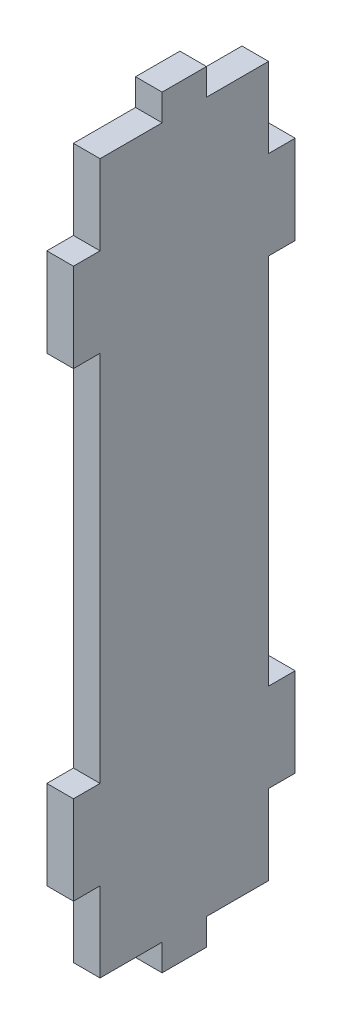
ISO-10303-21;
HEADER;
FILE_DESCRIPTION(('STEP AP214'),'2;1');
FILE_NAME('part.step','',(''),(''),'','','');
FILE_SCHEMA(('AUTOMOTIVE_DESIGN { 1 0 10303 214 1 1 1 1 }'));
ENDSEC;
DATA;
#1=APPLICATION_CONTEXT('core data for automotive mechanical design processes');
#2=APPLICATION_PROTOCOL_DEFINITION('international standard','automotive_design',2000,#1);
#3=PRODUCT_CONTEXT('',#1,'mechanical');
#4=PRODUCT('Part','Part','',(#3));
#5=PRODUCT_RELATED_PRODUCT_CATEGORY('part','',(#4));
#6=PRODUCT_DEFINITION_FORMATION('','',#4);
#7=PRODUCT_DEFINITION_CONTEXT('part definition',#1,'design');
#8=PRODUCT_DEFINITION('design','',#6,#7);
#9=PRODUCT_DEFINITION_SHAPE('','',#8);
#10=(LENGTH_UNIT() NAMED_UNIT(*) SI_UNIT(.MILLI.,.METRE.));
#11=(NAMED_UNIT(*) PLANE_ANGLE_UNIT() SI_UNIT($,.RADIAN.));
#12=(NAMED_UNIT(*) SI_UNIT($,.STERADIAN.) SOLID_ANGLE_UNIT());
#13=UNCERTAINTY_MEASURE_WITH_UNIT(LENGTH_MEASURE(1.E-05),#10,'distance_accuracy_value','');
#14=(GEOMETRIC_REPRESENTATION_CONTEXT(3) GLOBAL_UNCERTAINTY_ASSIGNED_CONTEXT((#13)) GLOBAL_UNIT_ASSIGNED_CONTEXT((#10,
#11,#12)) REPRESENTATION_CONTEXT('',''));
#15=CARTESIAN_POINT('',(0.,0.,0.));
#16=DIRECTION('',(0.,0.,1.));
#17=DIRECTION('',(1.,0.,0.));
#18=AXIS2_PLACEMENT_3D('',#15,#16,#17);
#19=CARTESIAN_POINT('',(3.,0.,0.));
#20=DIRECTION('',(0.,1.,0.));
#21=DIRECTION('',(0.,0.,1.));
#22=AXIS2_PLACEMENT_3D('',#19,#20,#21);
#23=PLANE('',#22);
#24=DIRECTION('',(0.,0.,-1.));
#25=VECTOR('',#24,1.);
#26=CARTESIAN_POINT('',(3.,0.,0.));
#27=LINE('',#26,#25);
#28=CARTESIAN_POINT('',(3.,0.,-10.));
#29=VERTEX_POINT('',#28);
#30=CARTESIAN_POINT('',(3.,0.,-15.));
#31=VERTEX_POINT('',#30);
#32=EDGE_CURVE('E417',#29,#31,#27,.T.);
#33=ORIENTED_EDGE('',*,*,#32,.F.);
#34=DIRECTION('',(1.,0.,0.));
#35=VECTOR('',#34,1.);
#36=CARTESIAN_POINT('',(0.,0.,-10.));
#37=LINE('',#36,#35);
#38=CARTESIAN_POINT('',(0.,0.,-10.));
#39=VERTEX_POINT('',#38);
#40=EDGE_CURVE('E283',#39,#29,#37,.T.);
#41=ORIENTED_EDGE('',*,*,#40,.F.);
#42=DIRECTION('',(0.,0.,-1.));
#43=VECTOR('',#42,1.);
#44=CARTESIAN_POINT('',(0.,0.,0.));
#45=LINE('',#44,#43);
#46=CARTESIAN_POINT('',(0.,0.,-15.));
#47=VERTEX_POINT('',#46);
#48=EDGE_CURVE('E426',#39,#47,#45,.T.);
#49=ORIENTED_EDGE('',*,*,#48,.T.);
#50=DIRECTION('',(1.,0.,0.));
#51=VECTOR('',#50,1.);
#52=CARTESIAN_POINT('',(0.,0.,-15.));
#53=LINE('',#52,#51);
#54=EDGE_CURVE('E226',#47,#31,#53,.T.);
#55=ORIENTED_EDGE('',*,*,#54,.T.);
#56=EDGE_LOOP('',(#33,#41,#49,#55));
#57=FACE_BOUND('',#56,.T.);
#58=ADVANCED_FACE('F33',(#57),#23,.F.);
#59=CARTESIAN_POINT('',(3.,86.,0.));
#60=DIRECTION('',(0.,-1.,0.));
#61=DIRECTION('',(0.,0.,-1.));
#62=AXIS2_PLACEMENT_3D('',#59,#60,#61);
#63=PLANE('',#62);
#64=DIRECTION('',(0.,0.,1.));
#65=VECTOR('',#64,1.);
#66=CARTESIAN_POINT('',(3.,86.,0.));
#67=LINE('',#66,#65);
#68=CARTESIAN_POINT('',(3.,86.,-15.));
#69=VERTEX_POINT('',#68);
#70=CARTESIAN_POINT('',(3.,86.,-10.));
#71=VERTEX_POINT('',#70);
#72=EDGE_CURVE('E12',#69,#71,#67,.T.);
#73=ORIENTED_EDGE('',*,*,#72,.F.);
#74=DIRECTION('',(1.,0.,0.));
#75=VECTOR('',#74,1.);
#76=CARTESIAN_POINT('',(0.,86.,-15.));
#77=LINE('',#76,#75);
#78=CARTESIAN_POINT('',(0.,86.,-15.));
#79=VERTEX_POINT('',#78);
#80=EDGE_CURVE('E259',#79,#69,#77,.T.);
#81=ORIENTED_EDGE('',*,*,#80,.F.);
#82=DIRECTION('',(0.,0.,1.));
#83=VECTOR('',#82,1.);
#84=CARTESIAN_POINT('',(0.,86.,0.));
#85=LINE('',#84,#83);
#86=CARTESIAN_POINT('',(0.,86.,-10.));
#87=VERTEX_POINT('',#86);
#88=EDGE_CURVE('E37',#79,#87,#85,.T.);
#89=ORIENTED_EDGE('',*,*,#88,.T.);
#90=DIRECTION('',(1.,0.,0.));
#91=VECTOR('',#90,1.);
#92=CARTESIAN_POINT('',(0.,86.,-10.));
#93=LINE('',#92,#91);
#94=EDGE_CURVE('E290',#87,#71,#93,.T.);
#95=ORIENTED_EDGE('',*,*,#94,.T.);
#96=EDGE_LOOP('',(#73,#81,#89,#95));
#97=FACE_BOUND('',#96,.T.);
#98=ADVANCED_FACE('F442',(#97),#63,.F.);
#99=CARTESIAN_POINT('',(3.,0.,0.));
#100=DIRECTION('',(-1.,0.,0.));
#101=DIRECTION('',(0.,0.,1.));
#102=AXIS2_PLACEMENT_3D('',#99,#100,#101);
#103=PLANE('',#102);
#104=DIRECTION('',(0.,-1.,0.));
#105=VECTOR('',#104,1.);
#106=CARTESIAN_POINT('',(3.,86.,-22.));
#107=LINE('',#106,#105);
#108=CARTESIAN_POINT('',(3.,83.,-22.));
#109=VERTEX_POINT('',#108);
#110=CARTESIAN_POINT('',(3.,74.,-22.));
#111=VERTEX_POINT('',#110);
#112=EDGE_CURVE('E335',#109,#111,#107,.T.);
#113=ORIENTED_EDGE('',*,*,#112,.F.);
#114=DIRECTION('',(0.,0.,-1.));
#115=VECTOR('',#114,1.);
#116=CARTESIAN_POINT('',(3.,83.,0.));
#117=LINE('',#116,#115);
#118=CARTESIAN_POINT('',(3.,83.,-15.));
#119=VERTEX_POINT('',#118);
#120=EDGE_CURVE('E257',#119,#109,#117,.T.);
#121=ORIENTED_EDGE('',*,*,#120,.F.);
#122=DIRECTION('',(0.,-1.,0.));
#123=VECTOR('',#122,1.);
#124=CARTESIAN_POINT('',(3.,0.,-15.));
#125=LINE('',#124,#123);
#126=EDGE_CURVE('E260',#69,#119,#125,.T.);
#127=ORIENTED_EDGE('',*,*,#126,.F.);
#128=ORIENTED_EDGE('',*,*,#72,.T.);
#129=DIRECTION('',(0.,-1.,0.));
#130=VECTOR('',#129,1.);
#131=CARTESIAN_POINT('',(3.,0.,-10.));
#132=LINE('',#131,#130);
#133=CARTESIAN_POINT('',(3.,83.,-10.));
#134=VERTEX_POINT('',#133);
#135=EDGE_CURVE('E268',#71,#134,#132,.T.);
#136=ORIENTED_EDGE('',*,*,#135,.T.);
#137=DIRECTION('',(0.,0.,-1.));
#138=VECTOR('',#137,1.);
#139=CARTESIAN_POINT('',(3.,83.,0.));
#140=LINE('',#139,#138);
#141=CARTESIAN_POINT('',(3.,83.,-3.));
#142=VERTEX_POINT('',#141);
#143=EDGE_CURVE('E288',#142,#134,#140,.T.);
#144=ORIENTED_EDGE('',*,*,#143,.F.);
#145=DIRECTION('',(0.,1.,0.));
#146=VECTOR('',#145,1.);
#147=CARTESIAN_POINT('',(3.,86.,-3.));
#148=LINE('',#147,#146);
#149=CARTESIAN_POINT('',(3.,74.,-3.));
#150=VERTEX_POINT('',#149);
#151=EDGE_CURVE('E401',#150,#142,#148,.T.);
#152=ORIENTED_EDGE('',*,*,#151,.F.);
#153=DIRECTION('',(0.,0.,-1.));
#154=VECTOR('',#153,1.);
#155=CARTESIAN_POINT('',(3.,74.,0.));
#156=LINE('',#155,#154);
#157=CARTESIAN_POINT('',(3.,74.,0.));
#158=VERTEX_POINT('',#157);
#159=EDGE_CURVE('E342',#158,#150,#156,.T.);
#160=ORIENTED_EDGE('',*,*,#159,.F.);
#161=DIRECTION('',(0.,-1.,0.));
#162=VECTOR('',#161,1.);
#163=CARTESIAN_POINT('',(3.,0.,0.));
#164=LINE('',#163,#162);
#165=CARTESIAN_POINT('',(3.,64.,0.));
#166=VERTEX_POINT('',#165);
#167=EDGE_CURVE('E416',#158,#166,#164,.T.);
#168=ORIENTED_EDGE('',*,*,#167,.T.);
#169=DIRECTION('',(0.,0.,1.));
#170=VECTOR('',#169,1.);
#171=CARTESIAN_POINT('',(3.,64.,0.));
#172=LINE('',#171,#170);
#173=CARTESIAN_POINT('',(3.,64.,-3.));
#174=VERTEX_POINT('',#173);
#175=EDGE_CURVE('E377',#174,#166,#172,.T.);
#176=ORIENTED_EDGE('',*,*,#175,.F.);
#177=DIRECTION('',(0.,1.,0.));
#178=VECTOR('',#177,1.);
#179=CARTESIAN_POINT('',(3.,64.,-3.));
#180=LINE('',#179,#178);
#181=CARTESIAN_POINT('',(3.,22.,-3.00000000000001));
#182=VERTEX_POINT('',#181);
#183=EDGE_CURVE('E386',#182,#174,#180,.T.);
#184=ORIENTED_EDGE('',*,*,#183,.F.);
#185=DIRECTION('',(0.,0.,-1.));
#186=VECTOR('',#185,1.);
#187=CARTESIAN_POINT('',(3.,22.,0.));
#188=LINE('',#187,#186);
#189=CARTESIAN_POINT('',(3.,22.,0.));
#190=VERTEX_POINT('',#189);
#191=EDGE_CURVE('E322',#190,#182,#188,.T.);
#192=ORIENTED_EDGE('',*,*,#191,.F.);
#193=CARTESIAN_POINT('',(3.,12.,0.));
#194=VERTEX_POINT('',#193);
#195=EDGE_CURVE('E413',#190,#194,#164,.T.);
#196=ORIENTED_EDGE('',*,*,#195,.T.);
#197=DIRECTION('',(0.,0.,1.));
#198=VECTOR('',#197,1.);
#199=CARTESIAN_POINT('',(3.,12.,0.));
#200=LINE('',#199,#198);
#201=CARTESIAN_POINT('',(3.,12.,-3.));
#202=VERTEX_POINT('',#201);
#203=EDGE_CURVE('E361',#202,#194,#200,.T.);
#204=ORIENTED_EDGE('',*,*,#203,.F.);
#205=DIRECTION('',(0.,1.,0.));
#206=VECTOR('',#205,1.);
#207=CARTESIAN_POINT('',(3.,0.,-3.));
#208=LINE('',#207,#206);
#209=CARTESIAN_POINT('',(3.,3.,-3.));
#210=VERTEX_POINT('',#209);
#211=EDGE_CURVE('E365',#210,#202,#208,.T.);
#212=ORIENTED_EDGE('',*,*,#211,.F.);
#213=DIRECTION('',(0.,0.,-1.));
#214=VECTOR('',#213,1.);
#215=CARTESIAN_POINT('',(3.,3.,0.));
#216=LINE('',#215,#214);
#217=CARTESIAN_POINT('',(3.,3.,-10.));
#218=VERTEX_POINT('',#217);
#219=EDGE_CURVE('E58',#210,#218,#216,.T.);
#220=ORIENTED_EDGE('',*,*,#219,.T.);
#221=DIRECTION('',(0.,1.,0.));
#222=VECTOR('',#221,1.);
#223=CARTESIAN_POINT('',(3.,0.,-10.));
#224=LINE('',#223,#222);
#225=EDGE_CURVE('E275',#29,#218,#224,.T.);
#226=ORIENTED_EDGE('',*,*,#225,.F.);
#227=ORIENTED_EDGE('',*,*,#32,.T.);
#228=DIRECTION('',(0.,1.,0.));
#229=VECTOR('',#228,1.);
#230=CARTESIAN_POINT('',(3.,0.,-15.));
#231=LINE('',#230,#229);
#232=CARTESIAN_POINT('',(3.,3.,-15.));
#233=VERTEX_POINT('',#232);
#234=EDGE_CURVE('E245',#31,#233,#231,.T.);
#235=ORIENTED_EDGE('',*,*,#234,.T.);
#236=DIRECTION('',(0.,0.,-1.));
#237=VECTOR('',#236,1.);
#238=CARTESIAN_POINT('',(3.,3.,0.));
#239=LINE('',#238,#237);
#240=CARTESIAN_POINT('',(3.,3.,-22.));
#241=VERTEX_POINT('',#240);
#242=EDGE_CURVE('E237',#233,#241,#239,.T.);
#243=ORIENTED_EDGE('',*,*,#242,.T.);
#244=DIRECTION('',(0.,-1.,0.));
#245=VECTOR('',#244,1.);
#246=CARTESIAN_POINT('',(3.,0.,-22.));
#247=LINE('',#246,#245);
#248=CARTESIAN_POINT('',(3.,12.,-22.));
#249=VERTEX_POINT('',#248);
#250=EDGE_CURVE('E347',#249,#241,#247,.T.);
#251=ORIENTED_EDGE('',*,*,#250,.F.);
#252=DIRECTION('',(0.,0.,1.));
#253=VECTOR('',#252,1.);
#254=CARTESIAN_POINT('',(3.,12.,-25.));
#255=LINE('',#254,#253);
#256=CARTESIAN_POINT('',(3.,12.,-25.));
#257=VERTEX_POINT('',#256);
#258=EDGE_CURVE('E350',#257,#249,#255,.T.);
#259=ORIENTED_EDGE('',*,*,#258,.F.);
#260=DIRECTION('',(0.,1.,0.));
#261=VECTOR('',#260,1.);
#262=CARTESIAN_POINT('',(3.,0.,-25.));
#263=LINE('',#262,#261);
#264=CARTESIAN_POINT('',(3.,22.,-25.));
#265=VERTEX_POINT('',#264);
#266=EDGE_CURVE('E42',#257,#265,#263,.T.);
#267=ORIENTED_EDGE('',*,*,#266,.T.);
#268=DIRECTION('',(0.,0.,-1.));
#269=VECTOR('',#268,1.);
#270=CARTESIAN_POINT('',(3.,22.,-25.));
#271=LINE('',#270,#269);
#272=CARTESIAN_POINT('',(3.,22.,-22.));
#273=VERTEX_POINT('',#272);
#274=EDGE_CURVE('E306',#273,#265,#271,.T.);
#275=ORIENTED_EDGE('',*,*,#274,.F.);
#276=DIRECTION('',(0.,-1.,0.));
#277=VECTOR('',#276,1.);
#278=CARTESIAN_POINT('',(3.,64.,-22.));
#279=LINE('',#278,#277);
#280=CARTESIAN_POINT('',(3.,64.,-22.));
#281=VERTEX_POINT('',#280);
#282=EDGE_CURVE('E315',#281,#273,#279,.T.);
#283=ORIENTED_EDGE('',*,*,#282,.F.);
#284=DIRECTION('',(0.,0.,1.));
#285=VECTOR('',#284,1.);
#286=CARTESIAN_POINT('',(3.,64.,-25.));
#287=LINE('',#286,#285);
#288=CARTESIAN_POINT('',(3.,64.,-25.));
#289=VERTEX_POINT('',#288);
#290=EDGE_CURVE('E297',#289,#281,#287,.T.);
#291=ORIENTED_EDGE('',*,*,#290,.F.);
#292=CARTESIAN_POINT('',(3.,74.,-25.));
#293=VERTEX_POINT('',#292);
#294=EDGE_CURVE('E420',#289,#293,#263,.T.);
#295=ORIENTED_EDGE('',*,*,#294,.T.);
#296=DIRECTION('',(0.,0.,-1.));
#297=VECTOR('',#296,1.);
#298=CARTESIAN_POINT('',(3.,74.,-25.));
#299=LINE('',#298,#297);
#300=EDGE_CURVE('E331',#111,#293,#299,.T.);
#301=ORIENTED_EDGE('',*,*,#300,.F.);
#302=EDGE_LOOP('',(#113,#121,#127,#128,#136,#144,#152,#160,#168,#176,#184,#192,#196,#204,#212,
#220,#226,#227,#235,#243,#251,#259,#267,#275,#283,#291,#295,#301));
#303=FACE_BOUND('',#302,.T.);
#304=ADVANCED_FACE('F451',(#303),#103,.F.);
#305=CARTESIAN_POINT('',(0.,0.,0.));
#306=DIRECTION('',(-1.,0.,0.));
#307=DIRECTION('',(0.,0.,1.));
#308=AXIS2_PLACEMENT_3D('',#305,#306,#307);
#309=PLANE('',#308);
#310=DIRECTION('',(0.,0.,-1.));
#311=VECTOR('',#310,1.);
#312=CARTESIAN_POINT('',(0.,83.,0.));
#313=LINE('',#312,#311);
#314=CARTESIAN_POINT('',(0.,83.,-15.));
#315=VERTEX_POINT('',#314);
#316=CARTESIAN_POINT('',(0.,83.,-22.));
#317=VERTEX_POINT('',#316);
#318=EDGE_CURVE('E256',#315,#317,#313,.T.);
#319=ORIENTED_EDGE('',*,*,#318,.T.);
#320=DIRECTION('',(0.,-1.,0.));
#321=VECTOR('',#320,1.);
#322=CARTESIAN_POINT('',(0.,86.,-22.));
#323=LINE('',#322,#321);
#324=CARTESIAN_POINT('',(0.,74.,-22.));
#325=VERTEX_POINT('',#324);
#326=EDGE_CURVE('E328',#317,#325,#323,.T.);
#327=ORIENTED_EDGE('',*,*,#326,.T.);
#328=DIRECTION('',(0.,0.,-1.));
#329=VECTOR('',#328,1.);
#330=CARTESIAN_POINT('',(0.,74.,-25.));
#331=LINE('',#330,#329);
#332=CARTESIAN_POINT('',(0.,74.,-25.));
#333=VERTEX_POINT('',#332);
#334=EDGE_CURVE('E330',#325,#333,#331,.T.);
#335=ORIENTED_EDGE('',*,*,#334,.T.);
#336=DIRECTION('',(0.,1.,0.));
#337=VECTOR('',#336,1.);
#338=CARTESIAN_POINT('',(0.,0.,-25.));
#339=LINE('',#338,#337);
#340=CARTESIAN_POINT('',(0.,64.,-25.));
#341=VERTEX_POINT('',#340);
#342=EDGE_CURVE('E427',#341,#333,#339,.T.);
#343=ORIENTED_EDGE('',*,*,#342,.F.);
#344=DIRECTION('',(0.,0.,1.));
#345=VECTOR('',#344,1.);
#346=CARTESIAN_POINT('',(0.,64.,-25.));
#347=LINE('',#346,#345);
#348=CARTESIAN_POINT('',(0.,64.,-22.));
#349=VERTEX_POINT('',#348);
#350=EDGE_CURVE('E302',#341,#349,#347,.T.);
#351=ORIENTED_EDGE('',*,*,#350,.T.);
#352=DIRECTION('',(0.,-1.,0.));
#353=VECTOR('',#352,1.);
#354=CARTESIAN_POINT('',(0.,64.,-22.));
#355=LINE('',#354,#353);
#356=CARTESIAN_POINT('',(0.,22.,-22.));
#357=VERTEX_POINT('',#356);
#358=EDGE_CURVE('E305',#349,#357,#355,.T.);
#359=ORIENTED_EDGE('',*,*,#358,.T.);
#360=DIRECTION('',(0.,0.,-1.));
#361=VECTOR('',#360,1.);
#362=CARTESIAN_POINT('',(0.,22.,-25.));
#363=LINE('',#362,#361);
#364=CARTESIAN_POINT('',(0.,22.,-25.));
#365=VERTEX_POINT('',#364);
#366=EDGE_CURVE('E309',#357,#365,#363,.T.);
#367=ORIENTED_EDGE('',*,*,#366,.T.);
#368=CARTESIAN_POINT('',(0.,12.,-25.));
#369=VERTEX_POINT('',#368);
#370=EDGE_CURVE('E429',#369,#365,#339,.T.);
#371=ORIENTED_EDGE('',*,*,#370,.F.);
#372=DIRECTION('',(0.,0.,1.));
#373=VECTOR('',#372,1.);
#374=CARTESIAN_POINT('',(0.,12.,-25.));
#375=LINE('',#374,#373);
#376=CARTESIAN_POINT('',(0.,12.,-22.));
#377=VERTEX_POINT('',#376);
#378=EDGE_CURVE('E345',#369,#377,#375,.T.);
#379=ORIENTED_EDGE('',*,*,#378,.T.);
#380=DIRECTION('',(0.,-1.,0.));
#381=VECTOR('',#380,1.);
#382=CARTESIAN_POINT('',(0.,0.,-22.));
#383=LINE('',#382,#381);
#384=CARTESIAN_POINT('',(0.,3.,-22.));
#385=VERTEX_POINT('',#384);
#386=EDGE_CURVE('E244',#377,#385,#383,.T.);
#387=ORIENTED_EDGE('',*,*,#386,.T.);
#388=DIRECTION('',(0.,0.,-1.));
#389=VECTOR('',#388,1.);
#390=CARTESIAN_POINT('',(0.,3.,0.));
#391=LINE('',#390,#389);
#392=CARTESIAN_POINT('',(0.,3.,-15.));
#393=VERTEX_POINT('',#392);
#394=EDGE_CURVE('E231',#393,#385,#391,.T.);
#395=ORIENTED_EDGE('',*,*,#394,.F.);
#396=DIRECTION('',(0.,1.,0.));
#397=VECTOR('',#396,1.);
#398=CARTESIAN_POINT('',(0.,0.,-15.));
#399=LINE('',#398,#397);
#400=EDGE_CURVE('E220',#47,#393,#399,.T.);
#401=ORIENTED_EDGE('',*,*,#400,.F.);
#402=ORIENTED_EDGE('',*,*,#48,.F.);
#403=DIRECTION('',(0.,1.,0.));
#404=VECTOR('',#403,1.);
#405=CARTESIAN_POINT('',(0.,0.,-10.));
#406=LINE('',#405,#404);
#407=CARTESIAN_POINT('',(0.,3.,-10.));
#408=VERTEX_POINT('',#407);
#409=EDGE_CURVE('E274',#39,#408,#406,.T.);
#410=ORIENTED_EDGE('',*,*,#409,.T.);
#411=DIRECTION('',(0.,0.,-1.));
#412=VECTOR('',#411,1.);
#413=CARTESIAN_POINT('',(0.,3.,0.));
#414=LINE('',#413,#412);
#415=CARTESIAN_POINT('',(0.,3.,-3.));
#416=VERTEX_POINT('',#415);
#417=EDGE_CURVE('E272',#416,#408,#414,.T.);
#418=ORIENTED_EDGE('',*,*,#417,.F.);
#419=DIRECTION('',(0.,1.,0.));
#420=VECTOR('',#419,1.);
#421=CARTESIAN_POINT('',(0.,0.,-3.));
#422=LINE('',#421,#420);
#423=CARTESIAN_POINT('',(0.,12.,-3.));
#424=VERTEX_POINT('',#423);
#425=EDGE_CURVE('E358',#416,#424,#422,.T.);
#426=ORIENTED_EDGE('',*,*,#425,.T.);
#427=DIRECTION('',(0.,0.,1.));
#428=VECTOR('',#427,1.);
#429=CARTESIAN_POINT('',(0.,12.,0.));
#430=LINE('',#429,#428);
#431=CARTESIAN_POINT('',(0.,12.,0.));
#432=VERTEX_POINT('',#431);
#433=EDGE_CURVE('E360',#424,#432,#430,.T.);
#434=ORIENTED_EDGE('',*,*,#433,.T.);
#435=DIRECTION('',(0.,-1.,0.));
#436=VECTOR('',#435,1.);
#437=CARTESIAN_POINT('',(0.,0.,0.));
#438=LINE('',#437,#436);
#439=CARTESIAN_POINT('',(0.,22.,0.));
#440=VERTEX_POINT('',#439);
#441=EDGE_CURVE('E411',#440,#432,#438,.T.);
#442=ORIENTED_EDGE('',*,*,#441,.F.);
#443=DIRECTION('',(0.,0.,-1.));
#444=VECTOR('',#443,1.);
#445=CARTESIAN_POINT('',(0.,22.,0.));
#446=LINE('',#445,#444);
#447=CARTESIAN_POINT('',(0.,22.,-3.00000000000001));
#448=VERTEX_POINT('',#447);
#449=EDGE_CURVE('E373',#440,#448,#446,.T.);
#450=ORIENTED_EDGE('',*,*,#449,.T.);
#451=DIRECTION('',(0.,1.,0.));
#452=VECTOR('',#451,1.);
#453=CARTESIAN_POINT('',(0.,64.,-3.));
#454=LINE('',#453,#452);
#455=CARTESIAN_POINT('',(0.,64.,-3.));
#456=VERTEX_POINT('',#455);
#457=EDGE_CURVE('E376',#448,#456,#454,.T.);
#458=ORIENTED_EDGE('',*,*,#457,.T.);
#459=DIRECTION('',(0.,0.,1.));
#460=VECTOR('',#459,1.);
#461=CARTESIAN_POINT('',(0.,64.,0.));
#462=LINE('',#461,#460);
#463=CARTESIAN_POINT('',(0.,64.,0.));
#464=VERTEX_POINT('',#463);
#465=EDGE_CURVE('E380',#456,#464,#462,.T.);
#466=ORIENTED_EDGE('',*,*,#465,.T.);
#467=CARTESIAN_POINT('',(0.,74.,0.));
#468=VERTEX_POINT('',#467);
#469=EDGE_CURVE('E425',#468,#464,#438,.T.);
#470=ORIENTED_EDGE('',*,*,#469,.F.);
#471=DIRECTION('',(0.,0.,-1.));
#472=VECTOR('',#471,1.);
#473=CARTESIAN_POINT('',(0.,74.,0.));
#474=LINE('',#473,#472);
#475=CARTESIAN_POINT('',(0.,74.,-3.));
#476=VERTEX_POINT('',#475);
#477=EDGE_CURVE('E397',#468,#476,#474,.T.);
#478=ORIENTED_EDGE('',*,*,#477,.T.);
#479=DIRECTION('',(0.,1.,0.));
#480=VECTOR('',#479,1.);
#481=CARTESIAN_POINT('',(0.,86.,-3.));
#482=LINE('',#481,#480);
#483=CARTESIAN_POINT('',(0.,83.,-3.));
#484=VERTEX_POINT('',#483);
#485=EDGE_CURVE('E400',#476,#484,#482,.T.);
#486=ORIENTED_EDGE('',*,*,#485,.T.);
#487=DIRECTION('',(0.,0.,-1.));
#488=VECTOR('',#487,1.);
#489=CARTESIAN_POINT('',(0.,83.,0.));
#490=LINE('',#489,#488);
#491=CARTESIAN_POINT('',(0.,83.,-10.));
#492=VERTEX_POINT('',#491);
#493=EDGE_CURVE('E50',#484,#492,#490,.T.);
#494=ORIENTED_EDGE('',*,*,#493,.T.);
#495=DIRECTION('',(0.,-1.,0.));
#496=VECTOR('',#495,1.);
#497=CARTESIAN_POINT('',(0.,0.,-10.));
#498=LINE('',#497,#496);
#499=EDGE_CURVE('E286',#87,#492,#498,.T.);
#500=ORIENTED_EDGE('',*,*,#499,.F.);
#501=ORIENTED_EDGE('',*,*,#88,.F.);
#502=DIRECTION('',(0.,-1.,0.));
#503=VECTOR('',#502,1.);
#504=CARTESIAN_POINT('',(0.,0.,-15.));
#505=LINE('',#504,#503);
#506=EDGE_CURVE('E253',#79,#315,#505,.T.);
#507=ORIENTED_EDGE('',*,*,#506,.T.);
#508=EDGE_LOOP('',(#319,#327,#335,#343,#351,#359,#367,#371,#379,#387,#395,#401,#402,#410,#418,
#426,#434,#442,#450,#458,#466,#470,#478,#486,#494,#500,#501,#507));
#509=FACE_BOUND('',#508,.T.);
#510=ADVANCED_FACE('F242',(#509),#309,.T.);
#511=CARTESIAN_POINT('',(0.,0.,-3.));
#512=DIRECTION('',(0.,0.,-1.));
#513=DIRECTION('',(0.,1.,0.));
#514=AXIS2_PLACEMENT_3D('',#511,#512,#513);
#515=PLANE('',#514);
#516=DIRECTION('',(1.,0.,0.));
#517=VECTOR('',#516,1.);
#518=CARTESIAN_POINT('',(0.,3.,-3.));
#519=LINE('',#518,#517);
#520=EDGE_CURVE('E278',#416,#210,#519,.T.);
#521=ORIENTED_EDGE('',*,*,#520,.T.);
#522=ORIENTED_EDGE('',*,*,#211,.T.);
#523=DIRECTION('',(1.,0.,0.));
#524=VECTOR('',#523,1.);
#525=CARTESIAN_POINT('',(0.,12.,-3.));
#526=LINE('',#525,#524);
#527=EDGE_CURVE('E364',#424,#202,#526,.T.);
#528=ORIENTED_EDGE('',*,*,#527,.F.);
#529=ORIENTED_EDGE('',*,*,#425,.F.);
#530=EDGE_LOOP('',(#521,#522,#528,#529));
#531=FACE_BOUND('',#530,.T.);
#532=ADVANCED_FACE('F492',(#531),#515,.F.);
#533=CARTESIAN_POINT('',(0.,0.,-22.));
#534=DIRECTION('',(0.,0.,1.));
#535=DIRECTION('',(1.,0.,0.));
#536=AXIS2_PLACEMENT_3D('',#533,#534,#535);
#537=PLANE('',#536);
#538=DIRECTION('',(1.,0.,0.));
#539=VECTOR('',#538,1.);
#540=CARTESIAN_POINT('',(0.,3.,-22.));
#541=LINE('',#540,#539);
#542=EDGE_CURVE('E250',#385,#241,#541,.T.);
#543=ORIENTED_EDGE('',*,*,#542,.F.);
#544=ORIENTED_EDGE('',*,*,#386,.F.);
#545=DIRECTION('',(1.,0.,0.));
#546=VECTOR('',#545,1.);
#547=CARTESIAN_POINT('',(0.,12.,-22.));
#548=LINE('',#547,#546);
#549=EDGE_CURVE('E337',#377,#249,#548,.T.);
#550=ORIENTED_EDGE('',*,*,#549,.T.);
#551=ORIENTED_EDGE('',*,*,#250,.T.);
#552=EDGE_LOOP('',(#543,#544,#550,#551));
#553=FACE_BOUND('',#552,.T.);
#554=ADVANCED_FACE('F489',(#553),#537,.F.);
#555=CARTESIAN_POINT('',(3.,0.,0.));
#556=DIRECTION('',(0.,0.,-1.));
#557=DIRECTION('',(-1.,0.,0.));
#558=AXIS2_PLACEMENT_3D('',#555,#556,#557);
#559=PLANE('',#558);
#560=ORIENTED_EDGE('',*,*,#469,.T.);
#561=DIRECTION('',(1.,0.,0.));
#562=VECTOR('',#561,1.);
#563=CARTESIAN_POINT('',(0.,64.,0.));
#564=LINE('',#563,#562);
#565=EDGE_CURVE('E367',#464,#166,#564,.T.);
#566=ORIENTED_EDGE('',*,*,#565,.T.);
#567=ORIENTED_EDGE('',*,*,#167,.F.);
#568=DIRECTION('',(1.,0.,0.));
#569=VECTOR('',#568,1.);
#570=CARTESIAN_POINT('',(0.,74.,0.));
#571=LINE('',#570,#569);
#572=EDGE_CURVE('E404',#468,#158,#571,.T.);
#573=ORIENTED_EDGE('',*,*,#572,.F.);
#574=EDGE_LOOP('',(#560,#566,#567,#573));
#575=FACE_BOUND('',#574,.T.);
#576=ADVANCED_FACE('F491',(#575),#559,.F.);
#577=CARTESIAN_POINT('',(3.,0.,-25.));
#578=DIRECTION('',(0.,0.,1.));
#579=DIRECTION('',(1.,0.,0.));
#580=AXIS2_PLACEMENT_3D('',#577,#578,#579);
#581=PLANE('',#580);
#582=ORIENTED_EDGE('',*,*,#266,.F.);
#583=DIRECTION('',(1.,0.,0.));
#584=VECTOR('',#583,1.);
#585=CARTESIAN_POINT('',(0.,12.,-25.));
#586=LINE('',#585,#584);
#587=EDGE_CURVE('E349',#369,#257,#586,.T.);
#588=ORIENTED_EDGE('',*,*,#587,.F.);
#589=ORIENTED_EDGE('',*,*,#370,.T.);
#590=DIRECTION('',(1.,0.,0.));
#591=VECTOR('',#590,1.);
#592=CARTESIAN_POINT('',(0.,22.,-25.));
#593=LINE('',#592,#591);
#594=EDGE_CURVE('E319',#365,#265,#593,.T.);
#595=ORIENTED_EDGE('',*,*,#594,.T.);
#596=EDGE_LOOP('',(#582,#588,#589,#595));
#597=FACE_BOUND('',#596,.T.);
#598=ADVANCED_FACE('F485',(#597),#581,.F.);
#599=ORIENTED_EDGE('',*,*,#441,.T.);
#600=DIRECTION('',(1.,0.,0.));
#601=VECTOR('',#600,1.);
#602=CARTESIAN_POINT('',(0.,12.,0.));
#603=LINE('',#602,#601);
#604=EDGE_CURVE('E353',#432,#194,#603,.T.);
#605=ORIENTED_EDGE('',*,*,#604,.T.);
#606=ORIENTED_EDGE('',*,*,#195,.F.);
#607=DIRECTION('',(1.,0.,0.));
#608=VECTOR('',#607,1.);
#609=CARTESIAN_POINT('',(0.,22.,0.));
#610=LINE('',#609,#608);
#611=EDGE_CURVE('E383',#440,#190,#610,.T.);
#612=ORIENTED_EDGE('',*,*,#611,.F.);
#613=EDGE_LOOP('',(#599,#605,#606,#612));
#614=FACE_BOUND('',#613,.T.);
#615=ADVANCED_FACE('F35',(#614),#559,.F.);
#616=ORIENTED_EDGE('',*,*,#342,.T.);
#617=DIRECTION('',(1.,0.,0.));
#618=VECTOR('',#617,1.);
#619=CARTESIAN_POINT('',(0.,74.,-25.));
#620=LINE('',#619,#618);
#621=EDGE_CURVE('E339',#333,#293,#620,.T.);
#622=ORIENTED_EDGE('',*,*,#621,.T.);
#623=ORIENTED_EDGE('',*,*,#294,.F.);
#624=DIRECTION('',(1.,0.,0.));
#625=VECTOR('',#624,1.);
#626=CARTESIAN_POINT('',(0.,64.,-25.));
#627=LINE('',#626,#625);
#628=EDGE_CURVE('E312',#341,#289,#627,.T.);
#629=ORIENTED_EDGE('',*,*,#628,.F.);
#630=EDGE_LOOP('',(#616,#622,#623,#629));
#631=FACE_BOUND('',#630,.T.);
#632=ADVANCED_FACE('F470',(#631),#581,.F.);
#633=CARTESIAN_POINT('',(0.,86.,-3.));
#634=DIRECTION('',(0.,0.,-1.));
#635=DIRECTION('',(0.,1.,0.));
#636=AXIS2_PLACEMENT_3D('',#633,#634,#635);
#637=PLANE('',#636);
#638=ORIENTED_EDGE('',*,*,#151,.T.);
#639=DIRECTION('',(1.,0.,0.));
#640=VECTOR('',#639,1.);
#641=CARTESIAN_POINT('',(0.,83.,-3.));
#642=LINE('',#641,#640);
#643=EDGE_CURVE('E298',#484,#142,#642,.T.);
#644=ORIENTED_EDGE('',*,*,#643,.F.);
#645=ORIENTED_EDGE('',*,*,#485,.F.);
#646=DIRECTION('',(1.,0.,0.));
#647=VECTOR('',#646,1.);
#648=CARTESIAN_POINT('',(0.,74.,-3.));
#649=LINE('',#648,#647);
#650=EDGE_CURVE('E409',#476,#150,#649,.T.);
#651=ORIENTED_EDGE('',*,*,#650,.T.);
#652=EDGE_LOOP('',(#638,#644,#645,#651));
#653=FACE_BOUND('',#652,.T.);
#654=ADVANCED_FACE('F512',(#653),#637,.F.);
#655=CARTESIAN_POINT('',(0.,74.,0.));
#656=DIRECTION('',(0.,-1.,0.));
#657=DIRECTION('',(0.,0.,-1.));
#658=AXIS2_PLACEMENT_3D('',#655,#656,#657);
#659=PLANE('',#658);
#660=ORIENTED_EDGE('',*,*,#159,.T.);
#661=ORIENTED_EDGE('',*,*,#650,.F.);
#662=ORIENTED_EDGE('',*,*,#477,.F.);
#663=ORIENTED_EDGE('',*,*,#572,.T.);
#664=EDGE_LOOP('',(#660,#661,#662,#663));
#665=FACE_BOUND('',#664,.T.);
#666=ADVANCED_FACE('F518',(#665),#659,.F.);
#667=CARTESIAN_POINT('',(0.,22.,-25.));
#668=DIRECTION('',(0.,-1.,0.));
#669=DIRECTION('',(0.,0.,-1.));
#670=AXIS2_PLACEMENT_3D('',#667,#668,#669);
#671=PLANE('',#670);
#672=ORIENTED_EDGE('',*,*,#274,.T.);
#673=ORIENTED_EDGE('',*,*,#594,.F.);
#674=ORIENTED_EDGE('',*,*,#366,.F.);
#675=DIRECTION('',(1.,0.,0.));
#676=VECTOR('',#675,1.);
#677=CARTESIAN_POINT('',(0.,22.,-22.));
#678=LINE('',#677,#676);
#679=EDGE_CURVE('E323',#357,#273,#678,.T.);
#680=ORIENTED_EDGE('',*,*,#679,.T.);
#681=EDGE_LOOP('',(#672,#673,#674,#680));
#682=FACE_BOUND('',#681,.T.);
#683=ADVANCED_FACE('F479',(#682),#671,.F.);
#684=CARTESIAN_POINT('',(0.,64.,-22.));
#685=DIRECTION('',(0.,0.,1.));
#686=DIRECTION('',(0.,-1.,0.));
#687=AXIS2_PLACEMENT_3D('',#684,#685,#686);
#688=PLANE('',#687);
#689=ORIENTED_EDGE('',*,*,#282,.T.);
#690=ORIENTED_EDGE('',*,*,#679,.F.);
#691=ORIENTED_EDGE('',*,*,#358,.F.);
#692=DIRECTION('',(1.,0.,0.));
#693=VECTOR('',#692,1.);
#694=CARTESIAN_POINT('',(0.,64.,-22.));
#695=LINE('',#694,#693);
#696=EDGE_CURVE('E325',#349,#281,#695,.T.);
#697=ORIENTED_EDGE('',*,*,#696,.T.);
#698=EDGE_LOOP('',(#689,#690,#691,#697));
#699=FACE_BOUND('',#698,.T.);
#700=ADVANCED_FACE('F475',(#699),#688,.F.);
#701=CARTESIAN_POINT('',(0.,64.,-25.));
#702=DIRECTION('',(0.,1.,0.));
#703=DIRECTION('',(0.,0.,1.));
#704=AXIS2_PLACEMENT_3D('',#701,#702,#703);
#705=PLANE('',#704);
#706=ORIENTED_EDGE('',*,*,#290,.T.);
#707=ORIENTED_EDGE('',*,*,#696,.F.);
#708=ORIENTED_EDGE('',*,*,#350,.F.);
#709=ORIENTED_EDGE('',*,*,#628,.T.);
#710=EDGE_LOOP('',(#706,#707,#708,#709));
#711=FACE_BOUND('',#710,.T.);
#712=ADVANCED_FACE('F473',(#711),#705,.F.);
#713=CARTESIAN_POINT('',(0.,64.,0.));
#714=DIRECTION('',(0.,1.,0.));
#715=DIRECTION('',(0.,0.,1.));
#716=AXIS2_PLACEMENT_3D('',#713,#714,#715);
#717=PLANE('',#716);
#718=ORIENTED_EDGE('',*,*,#175,.T.);
#719=ORIENTED_EDGE('',*,*,#565,.F.);
#720=ORIENTED_EDGE('',*,*,#465,.F.);
#721=DIRECTION('',(1.,0.,0.));
#722=VECTOR('',#721,1.);
#723=CARTESIAN_POINT('',(0.,64.,-3.));
#724=LINE('',#723,#722);
#725=EDGE_CURVE('E392',#456,#174,#724,.T.);
#726=ORIENTED_EDGE('',*,*,#725,.T.);
#727=EDGE_LOOP('',(#718,#719,#720,#726));
#728=FACE_BOUND('',#727,.T.);
#729=ADVANCED_FACE('F533',(#728),#717,.F.);
#730=CARTESIAN_POINT('',(0.,64.,-3.));
#731=DIRECTION('',(0.,0.,-1.));
#732=DIRECTION('',(0.,1.,0.));
#733=AXIS2_PLACEMENT_3D('',#730,#731,#732);
#734=PLANE('',#733);
#735=ORIENTED_EDGE('',*,*,#183,.T.);
#736=ORIENTED_EDGE('',*,*,#725,.F.);
#737=ORIENTED_EDGE('',*,*,#457,.F.);
#738=DIRECTION('',(1.,0.,0.));
#739=VECTOR('',#738,1.);
#740=CARTESIAN_POINT('',(0.,22.,-3.00000000000001));
#741=LINE('',#740,#739);
#742=EDGE_CURVE('E394',#448,#182,#741,.T.);
#743=ORIENTED_EDGE('',*,*,#742,.T.);
#744=EDGE_LOOP('',(#735,#736,#737,#743));
#745=FACE_BOUND('',#744,.T.);
#746=ADVANCED_FACE('F529',(#745),#734,.F.);
#747=CARTESIAN_POINT('',(0.,22.,0.));
#748=DIRECTION('',(0.,-1.,0.));
#749=DIRECTION('',(0.,0.,-1.));
#750=AXIS2_PLACEMENT_3D('',#747,#748,#749);
#751=PLANE('',#750);
#752=ORIENTED_EDGE('',*,*,#191,.T.);
#753=ORIENTED_EDGE('',*,*,#742,.F.);
#754=ORIENTED_EDGE('',*,*,#449,.F.);
#755=ORIENTED_EDGE('',*,*,#611,.T.);
#756=EDGE_LOOP('',(#752,#753,#754,#755));
#757=FACE_BOUND('',#756,.T.);
#758=ADVANCED_FACE('F525',(#757),#751,.F.);
#759=CARTESIAN_POINT('',(0.,12.,0.));
#760=DIRECTION('',(0.,1.,0.));
#761=DIRECTION('',(0.,0.,1.));
#762=AXIS2_PLACEMENT_3D('',#759,#760,#761);
#763=PLANE('',#762);
#764=ORIENTED_EDGE('',*,*,#203,.T.);
#765=ORIENTED_EDGE('',*,*,#604,.F.);
#766=ORIENTED_EDGE('',*,*,#433,.F.);
#767=ORIENTED_EDGE('',*,*,#527,.T.);
#768=EDGE_LOOP('',(#764,#765,#766,#767));
#769=FACE_BOUND('',#768,.T.);
#770=ADVANCED_FACE('F528',(#769),#763,.F.);
#771=CARTESIAN_POINT('',(0.,12.,-25.));
#772=DIRECTION('',(0.,1.,0.));
#773=DIRECTION('',(0.,0.,1.));
#774=AXIS2_PLACEMENT_3D('',#771,#772,#773);
#775=PLANE('',#774);
#776=ORIENTED_EDGE('',*,*,#258,.T.);
#777=ORIENTED_EDGE('',*,*,#549,.F.);
#778=ORIENTED_EDGE('',*,*,#378,.F.);
#779=ORIENTED_EDGE('',*,*,#587,.T.);
#780=EDGE_LOOP('',(#776,#777,#778,#779));
#781=FACE_BOUND('',#780,.T.);
#782=ADVANCED_FACE('F482',(#781),#775,.F.);
#783=CARTESIAN_POINT('',(0.,74.,-25.));
#784=DIRECTION('',(0.,-1.,0.));
#785=DIRECTION('',(0.,0.,-1.));
#786=AXIS2_PLACEMENT_3D('',#783,#784,#785);
#787=PLANE('',#786);
#788=ORIENTED_EDGE('',*,*,#300,.T.);
#789=ORIENTED_EDGE('',*,*,#621,.F.);
#790=ORIENTED_EDGE('',*,*,#334,.F.);
#791=DIRECTION('',(1.,0.,0.));
#792=VECTOR('',#791,1.);
#793=CARTESIAN_POINT('',(0.,74.,-22.));
#794=LINE('',#793,#792);
#795=EDGE_CURVE('E334',#325,#111,#794,.T.);
#796=ORIENTED_EDGE('',*,*,#795,.T.);
#797=EDGE_LOOP('',(#788,#789,#790,#796));
#798=FACE_BOUND('',#797,.T.);
#799=ADVANCED_FACE('F466',(#798),#787,.F.);
#800=CARTESIAN_POINT('',(0.,86.,-22.));
#801=DIRECTION('',(0.,0.,1.));
#802=DIRECTION('',(1.,0.,0.));
#803=AXIS2_PLACEMENT_3D('',#800,#801,#802);
#804=PLANE('',#803);
#805=ORIENTED_EDGE('',*,*,#326,.F.);
#806=DIRECTION('',(1.,0.,0.));
#807=VECTOR('',#806,1.);
#808=CARTESIAN_POINT('',(0.,83.,-22.));
#809=LINE('',#808,#807);
#810=EDGE_CURVE('E265',#317,#109,#809,.T.);
#811=ORIENTED_EDGE('',*,*,#810,.T.);
#812=ORIENTED_EDGE('',*,*,#112,.T.);
#813=ORIENTED_EDGE('',*,*,#795,.F.);
#814=EDGE_LOOP('',(#805,#811,#812,#813));
#815=FACE_BOUND('',#814,.T.);
#816=ADVANCED_FACE('F463',(#815),#804,.F.);
#817=CARTESIAN_POINT('',(0.,83.,0.));
#818=DIRECTION('',(0.,-1.,0.));
#819=DIRECTION('',(0.,0.,-1.));
#820=AXIS2_PLACEMENT_3D('',#817,#818,#819);
#821=PLANE('',#820);
#822=ORIENTED_EDGE('',*,*,#120,.T.);
#823=ORIENTED_EDGE('',*,*,#810,.F.);
#824=ORIENTED_EDGE('',*,*,#318,.F.);
#825=DIRECTION('',(1.,0.,0.));
#826=VECTOR('',#825,1.);
#827=CARTESIAN_POINT('',(0.,83.,-15.));
#828=LINE('',#827,#826);
#829=EDGE_CURVE('E269',#315,#119,#828,.T.);
#830=ORIENTED_EDGE('',*,*,#829,.T.);
#831=EDGE_LOOP('',(#822,#823,#824,#830));
#832=FACE_BOUND('',#831,.T.);
#833=ADVANCED_FACE('F458',(#832),#821,.F.);
#834=CARTESIAN_POINT('',(0.,0.,-15.));
#835=DIRECTION('',(0.,0.,1.));
#836=DIRECTION('',(1.,0.,0.));
#837=AXIS2_PLACEMENT_3D('',#834,#835,#836);
#838=PLANE('',#837);
#839=ORIENTED_EDGE('',*,*,#126,.T.);
#840=ORIENTED_EDGE('',*,*,#829,.F.);
#841=ORIENTED_EDGE('',*,*,#506,.F.);
#842=ORIENTED_EDGE('',*,*,#80,.T.);
#843=EDGE_LOOP('',(#839,#840,#841,#842));
#844=FACE_BOUND('',#843,.T.);
#845=ADVANCED_FACE('F455',(#844),#838,.F.);
#846=CARTESIAN_POINT('',(0.,3.,0.));
#847=DIRECTION('',(0.,-1.,0.));
#848=DIRECTION('',(0.,0.,-1.));
#849=AXIS2_PLACEMENT_3D('',#846,#847,#848);
#850=PLANE('',#849);
#851=ORIENTED_EDGE('',*,*,#242,.F.);
#852=DIRECTION('',(1.,0.,0.));
#853=VECTOR('',#852,1.);
#854=CARTESIAN_POINT('',(0.,3.,-15.));
#855=LINE('',#854,#853);
#856=EDGE_CURVE('E223',#393,#233,#855,.T.);
#857=ORIENTED_EDGE('',*,*,#856,.F.);
#858=ORIENTED_EDGE('',*,*,#394,.T.);
#859=ORIENTED_EDGE('',*,*,#542,.T.);
#860=EDGE_LOOP('',(#851,#857,#858,#859));
#861=FACE_BOUND('',#860,.T.);
#862=ADVANCED_FACE('F234',(#861),#850,.T.);
#863=CARTESIAN_POINT('',(0.,0.,-15.));
#864=DIRECTION('',(0.,0.,-1.));
#865=DIRECTION('',(-1.,0.,0.));
#866=AXIS2_PLACEMENT_3D('',#863,#864,#865);
#867=PLANE('',#866);
#868=ORIENTED_EDGE('',*,*,#234,.F.);
#869=ORIENTED_EDGE('',*,*,#54,.F.);
#870=ORIENTED_EDGE('',*,*,#400,.T.);
#871=ORIENTED_EDGE('',*,*,#856,.T.);
#872=EDGE_LOOP('',(#868,#869,#870,#871));
#873=FACE_BOUND('',#872,.T.);
#874=ADVANCED_FACE('F222',(#873),#867,.T.);
#875=CARTESIAN_POINT('',(0.,3.,0.));
#876=DIRECTION('',(0.,-1.,0.));
#877=DIRECTION('',(0.,0.,-1.));
#878=AXIS2_PLACEMENT_3D('',#875,#876,#877);
#879=PLANE('',#878);
#880=ORIENTED_EDGE('',*,*,#219,.F.);
#881=ORIENTED_EDGE('',*,*,#520,.F.);
#882=ORIENTED_EDGE('',*,*,#417,.T.);
#883=DIRECTION('',(1.,0.,0.));
#884=VECTOR('',#883,1.);
#885=CARTESIAN_POINT('',(0.,3.,-10.));
#886=LINE('',#885,#884);
#887=EDGE_CURVE('E263',#408,#218,#886,.T.);
#888=ORIENTED_EDGE('',*,*,#887,.T.);
#889=EDGE_LOOP('',(#880,#881,#882,#888));
#890=FACE_BOUND('',#889,.T.);
#891=ADVANCED_FACE('F560',(#890),#879,.T.);
#892=CARTESIAN_POINT('',(0.,0.,-10.));
#893=DIRECTION('',(0.,0.,-1.));
#894=DIRECTION('',(-1.,0.,0.));
#895=AXIS2_PLACEMENT_3D('',#892,#893,#894);
#896=PLANE('',#895);
#897=ORIENTED_EDGE('',*,*,#225,.T.);
#898=ORIENTED_EDGE('',*,*,#887,.F.);
#899=ORIENTED_EDGE('',*,*,#409,.F.);
#900=ORIENTED_EDGE('',*,*,#40,.T.);
#901=EDGE_LOOP('',(#897,#898,#899,#900));
#902=FACE_BOUND('',#901,.T.);
#903=ADVANCED_FACE('F557',(#902),#896,.F.);
#904=CARTESIAN_POINT('',(0.,0.,-10.));
#905=DIRECTION('',(0.,0.,1.));
#906=DIRECTION('',(1.,0.,0.));
#907=AXIS2_PLACEMENT_3D('',#904,#905,#906);
#908=PLANE('',#907);
#909=ORIENTED_EDGE('',*,*,#135,.F.);
#910=ORIENTED_EDGE('',*,*,#94,.F.);
#911=ORIENTED_EDGE('',*,*,#499,.T.);
#912=DIRECTION('',(1.,0.,0.));
#913=VECTOR('',#912,1.);
#914=CARTESIAN_POINT('',(0.,83.,-10.));
#915=LINE('',#914,#913);
#916=EDGE_CURVE('E295',#492,#134,#915,.T.);
#917=ORIENTED_EDGE('',*,*,#916,.T.);
#918=EDGE_LOOP('',(#909,#910,#911,#917));
#919=FACE_BOUND('',#918,.T.);
#920=ADVANCED_FACE('F445',(#919),#908,.T.);
#921=CARTESIAN_POINT('',(0.,83.,0.));
#922=DIRECTION('',(0.,-1.,0.));
#923=DIRECTION('',(0.,0.,-1.));
#924=AXIS2_PLACEMENT_3D('',#921,#922,#923);
#925=PLANE('',#924);
#926=ORIENTED_EDGE('',*,*,#143,.T.);
#927=ORIENTED_EDGE('',*,*,#916,.F.);
#928=ORIENTED_EDGE('',*,*,#493,.F.);
#929=ORIENTED_EDGE('',*,*,#643,.T.);
#930=EDGE_LOOP('',(#926,#927,#928,#929));
#931=FACE_BOUND('',#930,.T.);
#932=ADVANCED_FACE('F446',(#931),#925,.F.);
#933=CLOSED_SHELL('',(#58,#98,#304,#510,#532,#554,#576,#598,#615,#632,#654,#666,#683,#700,#712,
#729,#746,#758,#770,#782,#799,#816,#833,#845,#862,#874,#891,#903,#920,#932));
#934=MANIFOLD_SOLID_BREP('B2',#933);
#935=ADVANCED_BREP_SHAPE_REPRESENTATION('',(#18,#934),#14);
#936=SHAPE_DEFINITION_REPRESENTATION(#9,#935);
ENDSEC;
END-ISO-10303-21;
